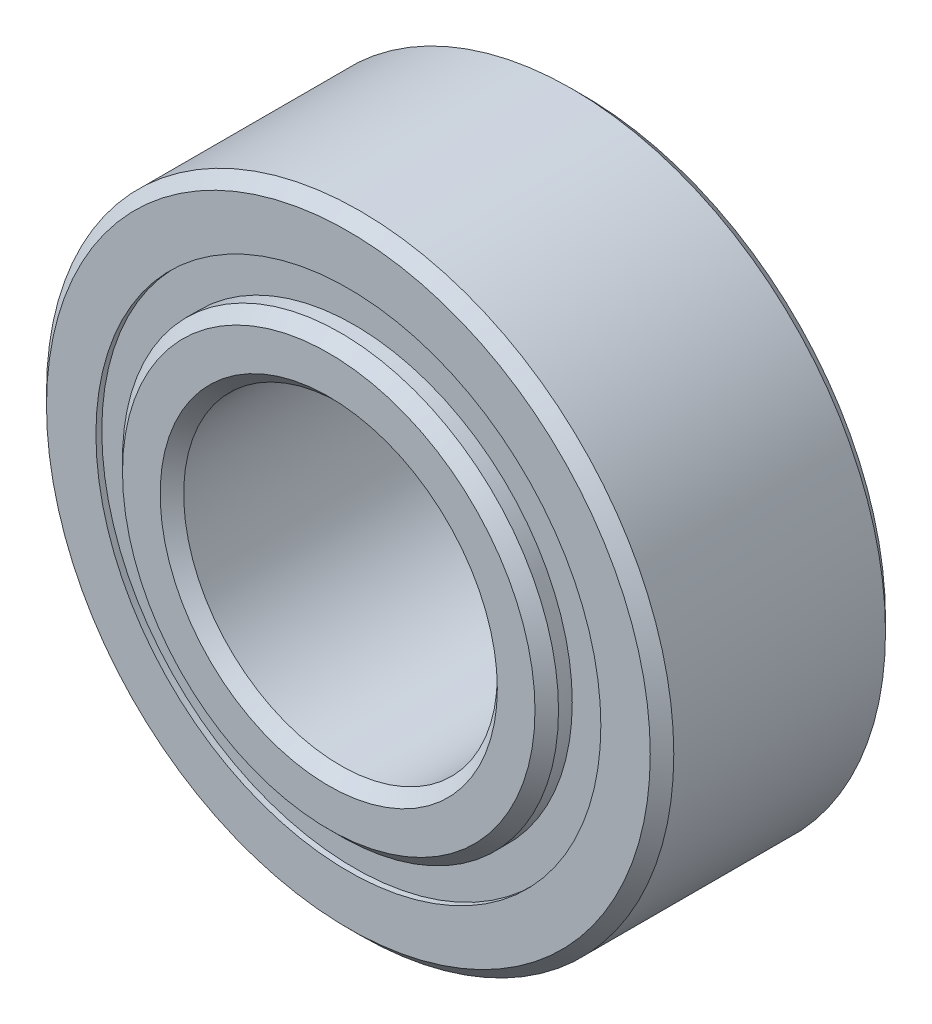
ISO-10303-21;
HEADER;
FILE_DESCRIPTION(('STEP AP214'),'2;1');
FILE_NAME('part.step','',(''),(''),'','','');
FILE_SCHEMA(('AUTOMOTIVE_DESIGN { 1 0 10303 214 1 1 1 1 }'));
ENDSEC;
DATA;
#1=APPLICATION_CONTEXT('core data for automotive mechanical design processes');
#2=APPLICATION_PROTOCOL_DEFINITION('international standard','automotive_design',2000,#1);
#3=PRODUCT_CONTEXT('',#1,'mechanical');
#4=PRODUCT('Part','Part','',(#3));
#5=PRODUCT_RELATED_PRODUCT_CATEGORY('part','',(#4));
#6=PRODUCT_DEFINITION_FORMATION('','',#4);
#7=PRODUCT_DEFINITION_CONTEXT('part definition',#1,'design');
#8=PRODUCT_DEFINITION('design','',#6,#7);
#9=PRODUCT_DEFINITION_SHAPE('','',#8);
#10=(LENGTH_UNIT() NAMED_UNIT(*) SI_UNIT(.MILLI.,.METRE.));
#11=(NAMED_UNIT(*) PLANE_ANGLE_UNIT() SI_UNIT($,.RADIAN.));
#12=(NAMED_UNIT(*) SI_UNIT($,.STERADIAN.) SOLID_ANGLE_UNIT());
#13=UNCERTAINTY_MEASURE_WITH_UNIT(LENGTH_MEASURE(1.E-05),#10,'distance_accuracy_value','');
#14=(GEOMETRIC_REPRESENTATION_CONTEXT(3) GLOBAL_UNCERTAINTY_ASSIGNED_CONTEXT((#13)) GLOBAL_UNIT_ASSIGNED_CONTEXT((#10,
#11,#12)) REPRESENTATION_CONTEXT('',''));
#15=CARTESIAN_POINT('',(0.,0.,0.));
#16=DIRECTION('',(0.,0.,1.));
#17=DIRECTION('',(1.,0.,0.));
#18=AXIS2_PLACEMENT_3D('',#15,#16,#17);
#19=CARTESIAN_POINT('',(0.,5.1114010989011,-2.2621875));
#20=DIRECTION('',(0.,0.,1.));
#21=DIRECTION('',(1.,0.,0.));
#22=AXIS2_PLACEMENT_3D('',#19,#20,#21);
#23=PLANE('',#22);
#24=CARTESIAN_POINT('',(0.,0.,-2.2621875));
#25=DIRECTION('',(0.,0.,1.));
#26=DIRECTION('',(1.,0.,0.));
#27=AXIS2_PLACEMENT_3D('',#24,#25,#26);
#28=CIRCLE('',#27,5.1114010989011);
#29=CARTESIAN_POINT('',(5.1114010989011,0.,-2.2621875));
#30=VERTEX_POINT('',#29);
#31=EDGE_CURVE('E59',#30,#30,#28,.T.);
#32=ORIENTED_EDGE('',*,*,#31,.F.);
#33=EDGE_LOOP('',(#32));
#34=FACE_BOUND('',#33,.T.);
#35=CARTESIAN_POINT('',(0.,0.,-2.2621875));
#36=DIRECTION('',(0.,0.,1.));
#37=DIRECTION('',(1.,0.,0.));
#38=AXIS2_PLACEMENT_3D('',#35,#36,#37);
#39=CIRCLE('',#38,4.41359890109897);
#40=CARTESIAN_POINT('',(4.41359890109897,0.,-2.2621875));
#41=VERTEX_POINT('',#40);
#42=EDGE_CURVE('E11',#41,#41,#39,.T.);
#43=ORIENTED_EDGE('',*,*,#42,.T.);
#44=EDGE_LOOP('',(#43));
#45=FACE_BOUND('',#44,.T.);
#46=ADVANCED_FACE('F45',(#34,#45),#23,.F.);
#47=CARTESIAN_POINT('',(0.,0.,2.38125));
#48=DIRECTION('',(0.,0.,1.));
#49=DIRECTION('',(1.,0.,0.));
#50=AXIS2_PLACEMENT_3D('',#47,#48,#49);
#51=CYLINDRICAL_SURFACE('',#50,4.41359890109897);
#52=ORIENTED_EDGE('',*,*,#42,.F.);
#53=EDGE_LOOP('',(#52));
#54=FACE_BOUND('',#53,.T.);
#55=CARTESIAN_POINT('',(0.,0.,-1.11436144103197));
#56=DIRECTION('',(0.,0.,1.));
#57=DIRECTION('',(1.,0.,0.));
#58=AXIS2_PLACEMENT_3D('',#55,#56,#57);
#59=CIRCLE('',#58,4.41359890109897);
#60=CARTESIAN_POINT('',(4.41359890109897,0.,-1.11436144103197));
#61=VERTEX_POINT('',#60);
#62=EDGE_CURVE('E51',#61,#61,#59,.T.);
#63=ORIENTED_EDGE('',*,*,#62,.T.);
#64=EDGE_LOOP('',(#63));
#65=FACE_BOUND('',#64,.T.);
#66=ADVANCED_FACE('F68',(#54,#65),#51,.F.);
#67=CARTESIAN_POINT('',(0.,5.1114010989011,-1.11436144103197));
#68=DIRECTION('',(0.,0.,-1.));
#69=DIRECTION('',(-1.,0.,0.));
#70=AXIS2_PLACEMENT_3D('',#67,#68,#69);
#71=PLANE('',#70);
#72=ORIENTED_EDGE('',*,*,#62,.F.);
#73=EDGE_LOOP('',(#72));
#74=FACE_BOUND('',#73,.T.);
#75=CARTESIAN_POINT('',(0.,0.,-1.11436144103197));
#76=DIRECTION('',(0.,0.,1.));
#77=DIRECTION('',(1.,0.,0.));
#78=AXIS2_PLACEMENT_3D('',#75,#76,#77);
#79=CIRCLE('',#78,5.1114010989011);
#80=CARTESIAN_POINT('',(5.1114010989011,0.,-1.11436144103197));
#81=VERTEX_POINT('',#80);
#82=EDGE_CURVE('E55',#81,#81,#79,.T.);
#83=ORIENTED_EDGE('',*,*,#82,.T.);
#84=EDGE_LOOP('',(#83));
#85=FACE_BOUND('',#84,.T.);
#86=ADVANCED_FACE('F72',(#74,#85),#71,.F.);
#87=CARTESIAN_POINT('',(0.,0.,2.38125));
#88=DIRECTION('',(0.,0.,1.));
#89=DIRECTION('',(1.,0.,0.));
#90=AXIS2_PLACEMENT_3D('',#87,#88,#89);
#91=CYLINDRICAL_SURFACE('',#90,5.1114010989011);
#92=ORIENTED_EDGE('',*,*,#82,.F.);
#93=EDGE_LOOP('',(#92));
#94=FACE_BOUND('',#93,.T.);
#95=ORIENTED_EDGE('',*,*,#31,.T.);
#96=EDGE_LOOP('',(#95));
#97=FACE_BOUND('',#96,.T.);
#98=ADVANCED_FACE('F65',(#94,#97),#91,.T.);
#99=CLOSED_SHELL('',(#46,#66,#86,#98));
#100=MANIFOLD_SOLID_BREP('B2',#99);
#101=CARTESIAN_POINT('',(0.,5.1114010989011,2.2621875));
#102=DIRECTION('',(0.,0.,-1.));
#103=DIRECTION('',(-1.,0.,0.));
#104=AXIS2_PLACEMENT_3D('',#101,#102,#103);
#105=PLANE('',#104);
#106=CARTESIAN_POINT('',(0.,0.,2.2621875));
#107=DIRECTION('',(0.,0.,1.));
#108=DIRECTION('',(1.,0.,0.));
#109=AXIS2_PLACEMENT_3D('',#106,#107,#108);
#110=CIRCLE('',#109,4.41359890109897);
#111=CARTESIAN_POINT('',(4.41359890109897,0.,2.2621875));
#112=VERTEX_POINT('',#111);
#113=EDGE_CURVE('E44',#112,#112,#110,.T.);
#114=ORIENTED_EDGE('',*,*,#113,.F.);
#115=EDGE_LOOP('',(#114));
#116=FACE_BOUND('',#115,.T.);
#117=CARTESIAN_POINT('',(0.,0.,2.2621875));
#118=DIRECTION('',(0.,0.,1.));
#119=DIRECTION('',(1.,0.,0.));
#120=AXIS2_PLACEMENT_3D('',#117,#118,#119);
#121=CIRCLE('',#120,5.1114010989011);
#122=CARTESIAN_POINT('',(5.1114010989011,0.,2.2621875));
#123=VERTEX_POINT('',#122);
#124=EDGE_CURVE('E126',#123,#123,#121,.T.);
#125=ORIENTED_EDGE('',*,*,#124,.T.);
#126=EDGE_LOOP('',(#125));
#127=FACE_BOUND('',#126,.T.);
#128=ADVANCED_FACE('F112',(#116,#127),#105,.F.);
#129=CARTESIAN_POINT('',(0.,0.,2.38125));
#130=DIRECTION('',(0.,0.,1.));
#131=DIRECTION('',(1.,0.,0.));
#132=AXIS2_PLACEMENT_3D('',#129,#130,#131);
#133=CYLINDRICAL_SURFACE('',#132,4.41359890109897);
#134=CARTESIAN_POINT('',(0.,0.,1.11436144103197));
#135=DIRECTION('',(0.,0.,1.));
#136=DIRECTION('',(1.,0.,0.));
#137=AXIS2_PLACEMENT_3D('',#134,#135,#136);
#138=CIRCLE('',#137,4.41359890109897);
#139=CARTESIAN_POINT('',(4.41359890109897,0.,1.11436144103197));
#140=VERTEX_POINT('',#139);
#141=EDGE_CURVE('E118',#140,#140,#138,.T.);
#142=ORIENTED_EDGE('',*,*,#141,.F.);
#143=EDGE_LOOP('',(#142));
#144=FACE_BOUND('',#143,.T.);
#145=ORIENTED_EDGE('',*,*,#113,.T.);
#146=EDGE_LOOP('',(#145));
#147=FACE_BOUND('',#146,.T.);
#148=ADVANCED_FACE('F141',(#144,#147),#133,.F.);
#149=CARTESIAN_POINT('',(0.,5.1114010989011,1.11436144103197));
#150=DIRECTION('',(0.,0.,1.));
#151=DIRECTION('',(1.,0.,0.));
#152=AXIS2_PLACEMENT_3D('',#149,#150,#151);
#153=PLANE('',#152);
#154=CARTESIAN_POINT('',(0.,0.,1.11436144103197));
#155=DIRECTION('',(0.,0.,1.));
#156=DIRECTION('',(1.,0.,0.));
#157=AXIS2_PLACEMENT_3D('',#154,#155,#156);
#158=CIRCLE('',#157,5.1114010989011);
#159=CARTESIAN_POINT('',(5.1114010989011,0.,1.11436144103197));
#160=VERTEX_POINT('',#159);
#161=EDGE_CURVE('E122',#160,#160,#158,.T.);
#162=ORIENTED_EDGE('',*,*,#161,.F.);
#163=EDGE_LOOP('',(#162));
#164=FACE_BOUND('',#163,.T.);
#165=ORIENTED_EDGE('',*,*,#141,.T.);
#166=EDGE_LOOP('',(#165));
#167=FACE_BOUND('',#166,.T.);
#168=ADVANCED_FACE('F136',(#164,#167),#153,.F.);
#169=CARTESIAN_POINT('',(0.,0.,2.38125));
#170=DIRECTION('',(0.,0.,1.));
#171=DIRECTION('',(1.,0.,0.));
#172=AXIS2_PLACEMENT_3D('',#169,#170,#171);
#173=CYLINDRICAL_SURFACE('',#172,5.1114010989011);
#174=ORIENTED_EDGE('',*,*,#124,.F.);
#175=EDGE_LOOP('',(#174));
#176=FACE_BOUND('',#175,.T.);
#177=ORIENTED_EDGE('',*,*,#161,.T.);
#178=EDGE_LOOP('',(#177));
#179=FACE_BOUND('',#178,.T.);
#180=ADVANCED_FACE('F133',(#176,#179),#173,.T.);
#181=CLOSED_SHELL('',(#128,#148,#168,#180));
#182=MANIFOLD_SOLID_BREP('B6',#181);
#183=CARTESIAN_POINT('',(-2.79932726404285,3.85294343571072,0.));
#184=DIRECTION('',(0.,0.,1.));
#185=DIRECTION('',(-0.587785252292462,0.809016994374955,0.));
#186=AXIS2_PLACEMENT_3D('',#183,#184,#185);
#187=SPHERICAL_SURFACE('',#186,1.11436144103197);
#188=CARTESIAN_POINT('',(-2.79932726404285,3.85294343571072,1.11436144103197));
#189=VERTEX_POINT('',#188);
#190=VERTEX_LOOP('',#189);
#191=FACE_BOUND('',#190,.T.);
#192=ADVANCED_FACE('F179',(#191),#187,.T.);
#193=CLOSED_SHELL('',(#192));
#194=MANIFOLD_SOLID_BREP('B39',#193);
#195=CARTESIAN_POINT('',(-4.52940665885565,1.47169343571074,0.));
#196=DIRECTION('',(0.,0.,1.));
#197=DIRECTION('',(-0.95105651629515,0.309016994374958,0.));
#198=AXIS2_PLACEMENT_3D('',#195,#196,#197);
#199=SPHERICAL_SURFACE('',#198,1.11436144103197);
#200=CARTESIAN_POINT('',(-4.52940665885565,1.47169343571074,1.11436144103197));
#201=VERTEX_POINT('',#200);
#202=VERTEX_LOOP('',#201);
#203=FACE_BOUND('',#202,.T.);
#204=ADVANCED_FACE('F199',(#203),#199,.T.);
#205=CLOSED_SHELL('',(#204));
#206=MANIFOLD_SOLID_BREP('B108',#205);
#207=CARTESIAN_POINT('',(-4.52940665885568,-1.47169343571064,0.));
#208=DIRECTION('',(0.,0.,1.));
#209=DIRECTION('',(-0.951056516295157,-0.309016994374938,0.));
#210=AXIS2_PLACEMENT_3D('',#207,#208,#209);
#211=SPHERICAL_SURFACE('',#210,1.11436144103197);
#212=CARTESIAN_POINT('',(-4.52940665885568,-1.47169343571064,1.11436144103197));
#213=VERTEX_POINT('',#212);
#214=VERTEX_LOOP('',#213);
#215=FACE_BOUND('',#214,.T.);
#216=ADVANCED_FACE('F219',(#215),#211,.T.);
#217=CLOSED_SHELL('',(#216));
#218=MANIFOLD_SOLID_BREP('B175',#217);
#219=CARTESIAN_POINT('',(-2.79932726404294,-3.85294343571066,0.));
#220=DIRECTION('',(0.,0.,1.));
#221=DIRECTION('',(-0.58778525229248,-0.809016994374942,0.));
#222=AXIS2_PLACEMENT_3D('',#219,#220,#221);
#223=SPHERICAL_SURFACE('',#222,1.11436144103197);
#224=CARTESIAN_POINT('',(-2.79932726404294,-3.85294343571066,1.11436144103197));
#225=VERTEX_POINT('',#224);
#226=VERTEX_LOOP('',#225);
#227=FACE_BOUND('',#226,.T.);
#228=ADVANCED_FACE('F239',(#227),#223,.T.);
#229=CLOSED_SHELL('',(#228));
#230=MANIFOLD_SOLID_BREP('B195',#229);
#231=CARTESIAN_POINT('',(0.,-4.7625,0.));
#232=DIRECTION('',(0.,0.,1.));
#233=DIRECTION('',(0.,-1.,0.));
#234=AXIS2_PLACEMENT_3D('',#231,#232,#233);
#235=SPHERICAL_SURFACE('',#234,1.11436144103197);
#236=CARTESIAN_POINT('',(0.,-4.7625,1.11436144103197));
#237=VERTEX_POINT('',#236);
#238=VERTEX_LOOP('',#237);
#239=FACE_BOUND('',#238,.T.);
#240=ADVANCED_FACE('F259',(#239),#235,.T.);
#241=CLOSED_SHELL('',(#240));
#242=MANIFOLD_SOLID_BREP('B215',#241);
#243=CARTESIAN_POINT('',(2.79932726404288,-3.8529434357107,0.));
#244=DIRECTION('',(0.,0.,1.));
#245=DIRECTION('',(0.587785252292469,-0.809016994374951,0.));
#246=AXIS2_PLACEMENT_3D('',#243,#244,#245);
#247=SPHERICAL_SURFACE('',#246,1.11436144103197);
#248=CARTESIAN_POINT('',(2.79932726404288,-3.8529434357107,1.11436144103197));
#249=VERTEX_POINT('',#248);
#250=VERTEX_LOOP('',#249);
#251=FACE_BOUND('',#250,.T.);
#252=ADVANCED_FACE('F279',(#251),#247,.T.);
#253=CLOSED_SHELL('',(#252));
#254=MANIFOLD_SOLID_BREP('B235',#253);
#255=CARTESIAN_POINT('',(4.52940665885566,-1.47169343571071,0.));
#256=DIRECTION('',(0.,0.,1.));
#257=DIRECTION('',(0.951056516295152,-0.309016994374952,0.));
#258=AXIS2_PLACEMENT_3D('',#255,#256,#257);
#259=SPHERICAL_SURFACE('',#258,1.11436144103197);
#260=CARTESIAN_POINT('',(4.52940665885566,-1.47169343571071,1.11436144103197));
#261=VERTEX_POINT('',#260);
#262=VERTEX_LOOP('',#261);
#263=FACE_BOUND('',#262,.T.);
#264=ADVANCED_FACE('F299',(#263),#259,.T.);
#265=CLOSED_SHELL('',(#264));
#266=MANIFOLD_SOLID_BREP('B255',#265);
#267=CARTESIAN_POINT('',(4.52940665885567,1.47169343571067,0.));
#268=DIRECTION('',(0.,0.,1.));
#269=DIRECTION('',(0.951056516295155,0.309016994374945,0.));
#270=AXIS2_PLACEMENT_3D('',#267,#268,#269);
#271=SPHERICAL_SURFACE('',#270,1.11436144103197);
#272=CARTESIAN_POINT('',(4.52940665885567,1.47169343571067,1.11436144103197));
#273=VERTEX_POINT('',#272);
#274=VERTEX_LOOP('',#273);
#275=FACE_BOUND('',#274,.T.);
#276=ADVANCED_FACE('F319',(#275),#271,.T.);
#277=CLOSED_SHELL('',(#276));
#278=MANIFOLD_SOLID_BREP('B275',#277);
#279=CARTESIAN_POINT('',(2.79932726404291,3.85294343571068,0.));
#280=DIRECTION('',(0.,0.,1.));
#281=DIRECTION('',(0.587785252292474,0.809016994374947,0.));
#282=AXIS2_PLACEMENT_3D('',#279,#280,#281);
#283=SPHERICAL_SURFACE('',#282,1.11436144103197);
#284=CARTESIAN_POINT('',(2.79932726404291,3.85294343571068,1.11436144103197));
#285=VERTEX_POINT('',#284);
#286=VERTEX_LOOP('',#285);
#287=FACE_BOUND('',#286,.T.);
#288=ADVANCED_FACE('F339',(#287),#283,.T.);
#289=CLOSED_SHELL('',(#288));
#290=MANIFOLD_SOLID_BREP('B295',#289);
#291=CARTESIAN_POINT('',(0.,4.7625,0.));
#292=DIRECTION('',(0.,0.,1.));
#293=DIRECTION('',(0.,1.,0.));
#294=AXIS2_PLACEMENT_3D('',#291,#292,#293);
#295=SPHERICAL_SURFACE('',#294,1.11436144103197);
#296=CARTESIAN_POINT('',(0.,4.7625,1.11436144103197));
#297=VERTEX_POINT('',#296);
#298=VERTEX_LOOP('',#297);
#299=FACE_BOUND('',#298,.T.);
#300=ADVANCED_FACE('F361',(#299),#295,.T.);
#301=CLOSED_SHELL('',(#300));
#302=MANIFOLD_SOLID_BREP('B315',#301);
#303=CARTESIAN_POINT('',(0.,0.,2.540635));
#304=DIRECTION('',(0.,0.,-1.));
#305=DIRECTION('',(-1.,0.,0.));
#306=AXIS2_PLACEMENT_3D('',#303,#304,#305);
#307=CONICAL_SURFACE('',#306,4.41359890109897,0.785398163397447);
#308=CARTESIAN_POINT('',(0.,0.,2.77876));
#309=DIRECTION('',(0.,0.,1.));
#310=DIRECTION('',(1.,0.,0.));
#311=AXIS2_PLACEMENT_3D('',#308,#309,#310);
#312=CIRCLE('',#311,4.17547390109897);
#313=CARTESIAN_POINT('',(4.17547390109897,0.,2.77876));
#314=VERTEX_POINT('',#313);
#315=EDGE_CURVE('E414',#314,#314,#312,.T.);
#316=ORIENTED_EDGE('',*,*,#315,.F.);
#317=EDGE_LOOP('',(#316));
#318=FACE_BOUND('',#317,.T.);
#319=CARTESIAN_POINT('',(0.,0.,2.540635));
#320=DIRECTION('',(0.,0.,1.));
#321=DIRECTION('',(1.,0.,0.));
#322=AXIS2_PLACEMENT_3D('',#319,#320,#321);
#323=CIRCLE('',#322,4.41359890109897);
#324=CARTESIAN_POINT('',(4.41359890109897,0.,2.540635));
#325=VERTEX_POINT('',#324);
#326=EDGE_CURVE('E360',#325,#325,#323,.T.);
#327=ORIENTED_EDGE('',*,*,#326,.T.);
#328=EDGE_LOOP('',(#327));
#329=FACE_BOUND('',#328,.T.);
#330=ADVANCED_FACE('F380',(#318,#329),#307,.T.);
#331=CARTESIAN_POINT('',(0.,0.,2.38125));
#332=DIRECTION('',(0.,0.,1.));
#333=DIRECTION('',(1.,0.,0.));
#334=AXIS2_PLACEMENT_3D('',#331,#332,#333);
#335=CYLINDRICAL_SURFACE('',#334,4.41359890109897);
#336=ORIENTED_EDGE('',*,*,#326,.F.);
#337=EDGE_LOOP('',(#336));
#338=FACE_BOUND('',#337,.T.);
#339=CARTESIAN_POINT('',(0.,0.,1.05833333333333));
#340=DIRECTION('',(0.,0.,1.));
#341=DIRECTION('',(1.,0.,0.));
#342=AXIS2_PLACEMENT_3D('',#339,#340,#341);
#343=CIRCLE('',#342,4.41359890109897);
#344=CARTESIAN_POINT('',(4.41359890109897,0.,1.05833333333333));
#345=VERTEX_POINT('',#344);
#346=EDGE_CURVE('E386',#345,#345,#343,.T.);
#347=ORIENTED_EDGE('',*,*,#346,.T.);
#348=EDGE_LOOP('',(#347));
#349=FACE_BOUND('',#348,.T.);
#350=ADVANCED_FACE('F421',(#338,#349),#335,.T.);
#351=CARTESIAN_POINT('',(0.,0.,0.));
#352=DIRECTION('',(0.,0.,1.));
#353=DIRECTION('',(1.,0.,0.));
#354=AXIS2_PLACEMENT_3D('',#351,#352,#353);
#355=TOROIDAL_SURFACE('',#354,4.76250000000006,1.11436144103196);
#356=ORIENTED_EDGE('',*,*,#346,.F.);
#357=EDGE_LOOP('',(#356));
#358=FACE_BOUND('',#357,.T.);
#359=CARTESIAN_POINT('',(0.,0.,-1.05833333333333));
#360=DIRECTION('',(0.,0.,1.));
#361=DIRECTION('',(1.,0.,0.));
#362=AXIS2_PLACEMENT_3D('',#359,#360,#361);
#363=CIRCLE('',#362,4.41359890109897);
#364=CARTESIAN_POINT('',(4.41359890109897,0.,-1.05833333333333));
#365=VERTEX_POINT('',#364);
#366=EDGE_CURVE('E390',#365,#365,#363,.T.);
#367=ORIENTED_EDGE('',*,*,#366,.T.);
#368=EDGE_LOOP('',(#367));
#369=FACE_BOUND('',#368,.T.);
#370=ADVANCED_FACE('F425',(#358,#369),#355,.F.);
#371=CARTESIAN_POINT('',(0.,0.,2.38125));
#372=DIRECTION('',(0.,0.,1.));
#373=DIRECTION('',(1.,0.,0.));
#374=AXIS2_PLACEMENT_3D('',#371,#372,#373);
#375=CYLINDRICAL_SURFACE('',#374,4.41359890109897);
#376=ORIENTED_EDGE('',*,*,#366,.F.);
#377=EDGE_LOOP('',(#376));
#378=FACE_BOUND('',#377,.T.);
#379=CARTESIAN_POINT('',(0.,0.,-2.540635));
#380=DIRECTION('',(0.,0.,1.));
#381=DIRECTION('',(1.,0.,0.));
#382=AXIS2_PLACEMENT_3D('',#379,#380,#381);
#383=CIRCLE('',#382,4.41359890109897);
#384=CARTESIAN_POINT('',(4.41359890109897,0.,-2.540635));
#385=VERTEX_POINT('',#384);
#386=EDGE_CURVE('E394',#385,#385,#383,.T.);
#387=ORIENTED_EDGE('',*,*,#386,.T.);
#388=EDGE_LOOP('',(#387));
#389=FACE_BOUND('',#388,.T.);
#390=ADVANCED_FACE('F430',(#378,#389),#375,.T.);
#391=CARTESIAN_POINT('',(0.,0.,-2.77876));
#392=DIRECTION('',(0.,0.,1.));
#393=DIRECTION('',(1.,0.,0.));
#394=AXIS2_PLACEMENT_3D('',#391,#392,#393);
#395=CONICAL_SURFACE('',#394,4.17547390109897,0.785398163397447);
#396=ORIENTED_EDGE('',*,*,#386,.F.);
#397=EDGE_LOOP('',(#396));
#398=FACE_BOUND('',#397,.T.);
#399=CARTESIAN_POINT('',(0.,0.,-2.77876));
#400=DIRECTION('',(0.,0.,1.));
#401=DIRECTION('',(1.,0.,0.));
#402=AXIS2_PLACEMENT_3D('',#399,#400,#401);
#403=CIRCLE('',#402,4.17547390109897);
#404=CARTESIAN_POINT('',(4.17547390109897,0.,-2.77876));
#405=VERTEX_POINT('',#404);
#406=EDGE_CURVE('E399',#405,#405,#403,.T.);
#407=ORIENTED_EDGE('',*,*,#406,.T.);
#408=EDGE_LOOP('',(#407));
#409=FACE_BOUND('',#408,.T.);
#410=ADVANCED_FACE('F436',(#398,#409),#395,.T.);
#411=CARTESIAN_POINT('',(0.,4.17547390109897,-2.77876));
#412=DIRECTION('',(0.,0.,1.));
#413=DIRECTION('',(1.,0.,0.));
#414=AXIS2_PLACEMENT_3D('',#411,#412,#413);
#415=PLANE('',#414);
#416=ORIENTED_EDGE('',*,*,#406,.F.);
#417=EDGE_LOOP('',(#416));
#418=FACE_BOUND('',#417,.T.);
#419=CARTESIAN_POINT('',(0.,0.,-2.77876));
#420=DIRECTION('',(0.,0.,1.));
#421=DIRECTION('',(1.,0.,0.));
#422=AXIS2_PLACEMENT_3D('',#419,#420,#421);
#423=CIRCLE('',#422,3.41312500000007);
#424=CARTESIAN_POINT('',(3.41312500000007,0.,-2.77876));
#425=VERTEX_POINT('',#424);
#426=EDGE_CURVE('E402',#425,#425,#423,.T.);
#427=ORIENTED_EDGE('',*,*,#426,.T.);
#428=EDGE_LOOP('',(#427));
#429=FACE_BOUND('',#428,.T.);
#430=ADVANCED_FACE('F440',(#418,#429),#415,.F.);
#431=CARTESIAN_POINT('',(0.,0.,-2.540635));
#432=DIRECTION('',(0.,0.,-1.));
#433=DIRECTION('',(-1.,0.,0.));
#434=AXIS2_PLACEMENT_3D('',#431,#432,#433);
#435=CONICAL_SURFACE('',#434,3.17500000000007,0.785398163397447);
#436=ORIENTED_EDGE('',*,*,#426,.F.);
#437=EDGE_LOOP('',(#436));
#438=FACE_BOUND('',#437,.T.);
#439=CARTESIAN_POINT('',(0.,0.,-2.540635));
#440=DIRECTION('',(0.,0.,1.));
#441=DIRECTION('',(1.,0.,0.));
#442=AXIS2_PLACEMENT_3D('',#439,#440,#441);
#443=CIRCLE('',#442,3.17500000000007);
#444=CARTESIAN_POINT('',(3.17500000000007,0.,-2.540635));
#445=VERTEX_POINT('',#444);
#446=EDGE_CURVE('E405',#445,#445,#443,.T.);
#447=ORIENTED_EDGE('',*,*,#446,.T.);
#448=EDGE_LOOP('',(#447));
#449=FACE_BOUND('',#448,.T.);
#450=ADVANCED_FACE('F444',(#438,#449),#435,.F.);
#451=CARTESIAN_POINT('',(0.,0.,2.38125));
#452=DIRECTION('',(0.,0.,1.));
#453=DIRECTION('',(1.,0.,0.));
#454=AXIS2_PLACEMENT_3D('',#451,#452,#453);
#455=CYLINDRICAL_SURFACE('',#454,3.17500000000007);
#456=ORIENTED_EDGE('',*,*,#446,.F.);
#457=EDGE_LOOP('',(#456));
#458=FACE_BOUND('',#457,.T.);
#459=CARTESIAN_POINT('',(0.,0.,2.540635));
#460=DIRECTION('',(0.,0.,1.));
#461=DIRECTION('',(1.,0.,0.));
#462=AXIS2_PLACEMENT_3D('',#459,#460,#461);
#463=CIRCLE('',#462,3.17500000000007);
#464=CARTESIAN_POINT('',(3.17500000000007,0.,2.540635));
#465=VERTEX_POINT('',#464);
#466=EDGE_CURVE('E408',#465,#465,#463,.T.);
#467=ORIENTED_EDGE('',*,*,#466,.T.);
#468=EDGE_LOOP('',(#467));
#469=FACE_BOUND('',#468,.T.);
#470=ADVANCED_FACE('F448',(#458,#469),#455,.F.);
#471=CARTESIAN_POINT('',(0.,0.,2.77876));
#472=DIRECTION('',(0.,0.,1.));
#473=DIRECTION('',(1.,0.,0.));
#474=AXIS2_PLACEMENT_3D('',#471,#472,#473);
#475=CONICAL_SURFACE('',#474,3.41312500000007,0.78539816339745);
#476=ORIENTED_EDGE('',*,*,#466,.F.);
#477=EDGE_LOOP('',(#476));
#478=FACE_BOUND('',#477,.T.);
#479=CARTESIAN_POINT('',(0.,0.,2.77876));
#480=DIRECTION('',(0.,0.,1.));
#481=DIRECTION('',(1.,0.,0.));
#482=AXIS2_PLACEMENT_3D('',#479,#480,#481);
#483=CIRCLE('',#482,3.41312500000007);
#484=CARTESIAN_POINT('',(3.41312500000007,0.,2.77876));
#485=VERTEX_POINT('',#484);
#486=EDGE_CURVE('E411',#485,#485,#483,.T.);
#487=ORIENTED_EDGE('',*,*,#486,.T.);
#488=EDGE_LOOP('',(#487));
#489=FACE_BOUND('',#488,.T.);
#490=ADVANCED_FACE('F452',(#478,#489),#475,.F.);
#491=CARTESIAN_POINT('',(0.,3.41312500000007,2.77876));
#492=DIRECTION('',(0.,0.,-1.));
#493=DIRECTION('',(-1.,0.,0.));
#494=AXIS2_PLACEMENT_3D('',#491,#492,#493);
#495=PLANE('',#494);
#496=ORIENTED_EDGE('',*,*,#486,.F.);
#497=EDGE_LOOP('',(#496));
#498=FACE_BOUND('',#497,.T.);
#499=ORIENTED_EDGE('',*,*,#315,.T.);
#500=EDGE_LOOP('',(#499));
#501=FACE_BOUND('',#500,.T.);
#502=ADVANCED_FACE('F418',(#498,#501),#495,.F.);
#503=CLOSED_SHELL('',(#330,#350,#370,#390,#410,#430,#450,#470,#490,#502));
#504=MANIFOLD_SOLID_BREP('B335',#503);
#505=CARTESIAN_POINT('',(0.,0.,2.143125));
#506=DIRECTION('',(0.,0.,-1.));
#507=DIRECTION('',(-1.,0.,0.));
#508=AXIS2_PLACEMENT_3D('',#505,#506,#507);
#509=CONICAL_SURFACE('',#508,6.35,0.785398163397447);
#510=CARTESIAN_POINT('',(0.,0.,2.38125));
#511=DIRECTION('',(0.,0.,1.));
#512=DIRECTION('',(1.,0.,0.));
#513=AXIS2_PLACEMENT_3D('',#510,#511,#512);
#514=CIRCLE('',#513,6.111875);
#515=CARTESIAN_POINT('',(6.111875,0.,2.38125));
#516=VERTEX_POINT('',#515);
#517=EDGE_CURVE('E559',#516,#516,#514,.T.);
#518=ORIENTED_EDGE('',*,*,#517,.F.);
#519=EDGE_LOOP('',(#518));
#520=FACE_BOUND('',#519,.T.);
#521=CARTESIAN_POINT('',(0.,0.,2.143125));
#522=DIRECTION('',(0.,0.,1.));
#523=DIRECTION('',(1.,0.,0.));
#524=AXIS2_PLACEMENT_3D('',#521,#522,#523);
#525=CIRCLE('',#524,6.35);
#526=CARTESIAN_POINT('',(6.35,0.,2.143125));
#527=VERTEX_POINT('',#526);
#528=EDGE_CURVE('E379',#527,#527,#525,.T.);
#529=ORIENTED_EDGE('',*,*,#528,.T.);
#530=EDGE_LOOP('',(#529));
#531=FACE_BOUND('',#530,.T.);
#532=ADVANCED_FACE('F531',(#520,#531),#509,.T.);
#533=CARTESIAN_POINT('',(0.,0.,2.38125));
#534=DIRECTION('',(0.,0.,1.));
#535=DIRECTION('',(1.,0.,0.));
#536=AXIS2_PLACEMENT_3D('',#533,#534,#535);
#537=CYLINDRICAL_SURFACE('',#536,6.35);
#538=ORIENTED_EDGE('',*,*,#528,.F.);
#539=EDGE_LOOP('',(#538));
#540=FACE_BOUND('',#539,.T.);
#541=CARTESIAN_POINT('',(0.,0.,-2.143125));
#542=DIRECTION('',(0.,0.,1.));
#543=DIRECTION('',(1.,0.,0.));
#544=AXIS2_PLACEMENT_3D('',#541,#542,#543);
#545=CIRCLE('',#544,6.35);
#546=CARTESIAN_POINT('',(6.35,0.,-2.143125));
#547=VERTEX_POINT('',#546);
#548=EDGE_CURVE('E537',#547,#547,#545,.T.);
#549=ORIENTED_EDGE('',*,*,#548,.T.);
#550=EDGE_LOOP('',(#549));
#551=FACE_BOUND('',#550,.T.);
#552=ADVANCED_FACE('F566',(#540,#551),#537,.T.);
#553=CARTESIAN_POINT('',(0.,0.,-2.38125));
#554=DIRECTION('',(0.,0.,1.));
#555=DIRECTION('',(1.,0.,0.));
#556=AXIS2_PLACEMENT_3D('',#553,#554,#555);
#557=CONICAL_SURFACE('',#556,6.111875,0.785398163397445);
#558=ORIENTED_EDGE('',*,*,#548,.F.);
#559=EDGE_LOOP('',(#558));
#560=FACE_BOUND('',#559,.T.);
#561=CARTESIAN_POINT('',(0.,0.,-2.38125));
#562=DIRECTION('',(0.,0.,1.));
#563=DIRECTION('',(1.,0.,0.));
#564=AXIS2_PLACEMENT_3D('',#561,#562,#563);
#565=CIRCLE('',#564,6.111875);
#566=CARTESIAN_POINT('',(6.111875,0.,-2.38125));
#567=VERTEX_POINT('',#566);
#568=EDGE_CURVE('E541',#567,#567,#565,.T.);
#569=ORIENTED_EDGE('',*,*,#568,.T.);
#570=EDGE_LOOP('',(#569));
#571=FACE_BOUND('',#570,.T.);
#572=ADVANCED_FACE('F570',(#560,#571),#557,.T.);
#573=CARTESIAN_POINT('',(0.,6.111875,-2.38125));
#574=DIRECTION('',(0.,0.,1.));
#575=DIRECTION('',(1.,0.,0.));
#576=AXIS2_PLACEMENT_3D('',#573,#574,#575);
#577=PLANE('',#576);
#578=ORIENTED_EDGE('',*,*,#568,.F.);
#579=EDGE_LOOP('',(#578));
#580=FACE_BOUND('',#579,.T.);
#581=CARTESIAN_POINT('',(0.,0.,-2.38125));
#582=DIRECTION('',(0.,0.,1.));
#583=DIRECTION('',(1.,0.,0.));
#584=AXIS2_PLACEMENT_3D('',#581,#582,#583);
#585=CIRCLE('',#584,5.1114010989011);
#586=CARTESIAN_POINT('',(5.1114010989011,0.,-2.38125));
#587=VERTEX_POINT('',#586);
#588=EDGE_CURVE('E545',#587,#587,#585,.T.);
#589=ORIENTED_EDGE('',*,*,#588,.T.);
#590=EDGE_LOOP('',(#589));
#591=FACE_BOUND('',#590,.T.);
#592=ADVANCED_FACE('F575',(#580,#591),#577,.F.);
#593=CARTESIAN_POINT('',(0.,0.,2.38125));
#594=DIRECTION('',(0.,0.,1.));
#595=DIRECTION('',(1.,0.,0.));
#596=AXIS2_PLACEMENT_3D('',#593,#594,#595);
#597=CYLINDRICAL_SURFACE('',#596,5.1114010989011);
#598=ORIENTED_EDGE('',*,*,#588,.F.);
#599=EDGE_LOOP('',(#598));
#600=FACE_BOUND('',#599,.T.);
#601=CARTESIAN_POINT('',(0.,0.,-1.05833333333333));
#602=DIRECTION('',(0.,0.,1.));
#603=DIRECTION('',(1.,0.,0.));
#604=AXIS2_PLACEMENT_3D('',#601,#602,#603);
#605=CIRCLE('',#604,5.1114010989011);
#606=CARTESIAN_POINT('',(5.1114010989011,0.,-1.05833333333333));
#607=VERTEX_POINT('',#606);
#608=EDGE_CURVE('E550',#607,#607,#605,.T.);
#609=ORIENTED_EDGE('',*,*,#608,.T.);
#610=EDGE_LOOP('',(#609));
#611=FACE_BOUND('',#610,.T.);
#612=ADVANCED_FACE('F581',(#600,#611),#597,.F.);
#613=CARTESIAN_POINT('',(0.,0.,0.));
#614=DIRECTION('',(0.,0.,1.));
#615=DIRECTION('',(1.,0.,0.));
#616=AXIS2_PLACEMENT_3D('',#613,#614,#615);
#617=TOROIDAL_SURFACE('',#616,4.7625,1.11436144103197);
#618=ORIENTED_EDGE('',*,*,#608,.F.);
#619=EDGE_LOOP('',(#618));
#620=FACE_BOUND('',#619,.T.);
#621=CARTESIAN_POINT('',(0.,0.,1.05833333333333));
#622=DIRECTION('',(0.,0.,1.));
#623=DIRECTION('',(1.,0.,0.));
#624=AXIS2_PLACEMENT_3D('',#621,#622,#623);
#625=CIRCLE('',#624,5.1114010989011);
#626=CARTESIAN_POINT('',(5.1114010989011,0.,1.05833333333333));
#627=VERTEX_POINT('',#626);
#628=EDGE_CURVE('E553',#627,#627,#625,.T.);
#629=ORIENTED_EDGE('',*,*,#628,.T.);
#630=EDGE_LOOP('',(#629));
#631=FACE_BOUND('',#630,.T.);
#632=ADVANCED_FACE('F585',(#620,#631),#617,.F.);
#633=CARTESIAN_POINT('',(0.,0.,2.38125));
#634=DIRECTION('',(0.,0.,1.));
#635=DIRECTION('',(1.,0.,0.));
#636=AXIS2_PLACEMENT_3D('',#633,#634,#635);
#637=CYLINDRICAL_SURFACE('',#636,5.1114010989011);
#638=ORIENTED_EDGE('',*,*,#628,.F.);
#639=EDGE_LOOP('',(#638));
#640=FACE_BOUND('',#639,.T.);
#641=CARTESIAN_POINT('',(0.,0.,2.38125));
#642=DIRECTION('',(0.,0.,1.));
#643=DIRECTION('',(1.,0.,0.));
#644=AXIS2_PLACEMENT_3D('',#641,#642,#643);
#645=CIRCLE('',#644,5.1114010989011);
#646=CARTESIAN_POINT('',(5.1114010989011,0.,2.38125));
#647=VERTEX_POINT('',#646);
#648=EDGE_CURVE('E556',#647,#647,#645,.T.);
#649=ORIENTED_EDGE('',*,*,#648,.T.);
#650=EDGE_LOOP('',(#649));
#651=FACE_BOUND('',#650,.T.);
#652=ADVANCED_FACE('F589',(#640,#651),#637,.F.);
#653=CARTESIAN_POINT('',(0.,6.111875,2.38125));
#654=DIRECTION('',(0.,0.,-1.));
#655=DIRECTION('',(-1.,0.,0.));
#656=AXIS2_PLACEMENT_3D('',#653,#654,#655);
#657=PLANE('',#656);
#658=ORIENTED_EDGE('',*,*,#648,.F.);
#659=EDGE_LOOP('',(#658));
#660=FACE_BOUND('',#659,.T.);
#661=ORIENTED_EDGE('',*,*,#517,.T.);
#662=EDGE_LOOP('',(#661));
#663=FACE_BOUND('',#662,.T.);
#664=ADVANCED_FACE('F563',(#660,#663),#657,.F.);
#665=CLOSED_SHELL('',(#532,#552,#572,#592,#612,#632,#652,#664));
#666=MANIFOLD_SOLID_BREP('B355',#665);
#667=ADVANCED_BREP_SHAPE_REPRESENTATION('',(#18,#100,#182,#194,#206,#218,#230,#242,#254,#266,
#278,#290,#302,#504,#666),#14);
#668=SHAPE_DEFINITION_REPRESENTATION(#9,#667);
ENDSEC;
END-ISO-10303-21;
